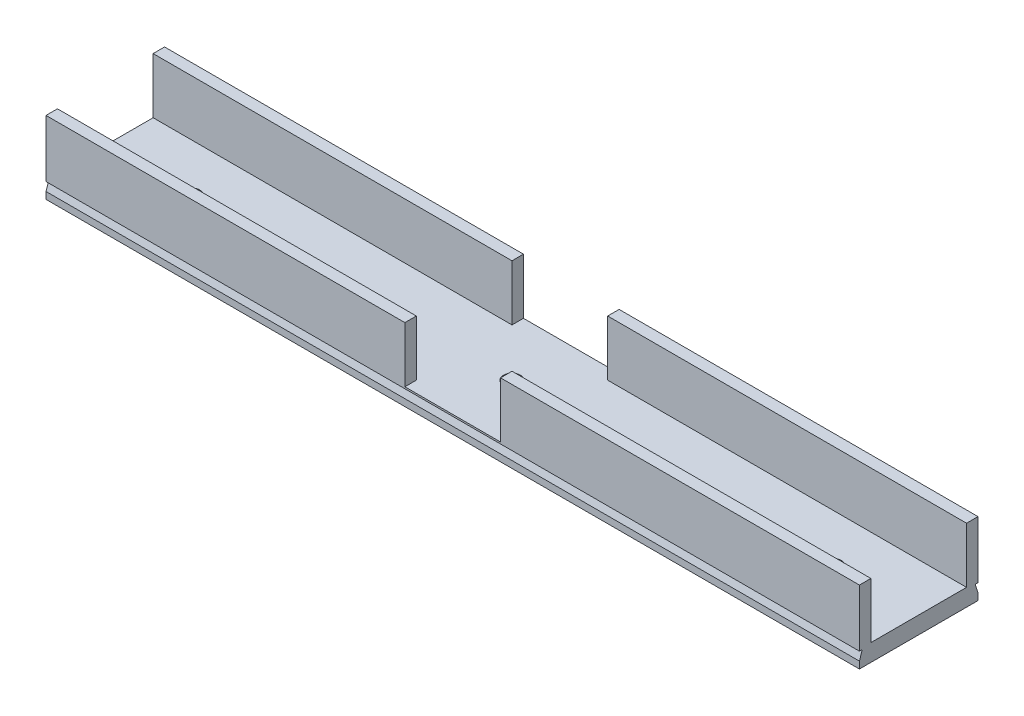
ISO-10303-21;
HEADER;
FILE_DESCRIPTION(('STEP AP214'),'2;1');
FILE_NAME('part.step','',(''),(''),'','','');
FILE_SCHEMA(('AUTOMOTIVE_DESIGN { 1 0 10303 214 1 1 1 1 }'));
ENDSEC;
DATA;
#1=APPLICATION_CONTEXT('core data for automotive mechanical design processes');
#2=APPLICATION_PROTOCOL_DEFINITION('international standard','automotive_design',2000,#1);
#3=PRODUCT_CONTEXT('',#1,'mechanical');
#4=PRODUCT('Part','Part','',(#3));
#5=PRODUCT_RELATED_PRODUCT_CATEGORY('part','',(#4));
#6=PRODUCT_DEFINITION_FORMATION('','',#4);
#7=PRODUCT_DEFINITION_CONTEXT('part definition',#1,'design');
#8=PRODUCT_DEFINITION('design','',#6,#7);
#9=PRODUCT_DEFINITION_SHAPE('','',#8);
#10=(LENGTH_UNIT() NAMED_UNIT(*) SI_UNIT(.MILLI.,.METRE.));
#11=(NAMED_UNIT(*) PLANE_ANGLE_UNIT() SI_UNIT($,.RADIAN.));
#12=(NAMED_UNIT(*) SI_UNIT($,.STERADIAN.) SOLID_ANGLE_UNIT());
#13=UNCERTAINTY_MEASURE_WITH_UNIT(LENGTH_MEASURE(1.E-05),#10,'distance_accuracy_value','');
#14=(GEOMETRIC_REPRESENTATION_CONTEXT(3) GLOBAL_UNCERTAINTY_ASSIGNED_CONTEXT((#13)) GLOBAL_UNIT_ASSIGNED_CONTEXT((#10,
#11,#12)) REPRESENTATION_CONTEXT('',''));
#15=CARTESIAN_POINT('',(0.,0.,0.));
#16=DIRECTION('',(0.,0.,1.));
#17=DIRECTION('',(1.,0.,0.));
#18=AXIS2_PLACEMENT_3D('',#15,#16,#17);
#19=CARTESIAN_POINT('',(71.,12.7,-8.35000000000002));
#20=DIRECTION('',(0.,0.,-1.));
#21=DIRECTION('',(-1.,0.,0.));
#22=AXIS2_PLACEMENT_3D('',#19,#20,#21);
#23=PLANE('',#22);
#24=DIRECTION('',(1.,0.,0.));
#25=VECTOR('',#24,1.);
#26=CARTESIAN_POINT('',(71.,3.,-8.35000000000002));
#27=LINE('',#26,#25);
#28=CARTESIAN_POINT('',(-71.,3.,-8.35000000000001));
#29=VERTEX_POINT('',#28);
#30=CARTESIAN_POINT('',(-8.35,2.99999999999999,-8.35000000000001));
#31=VERTEX_POINT('',#30);
#32=EDGE_CURVE('E302',#29,#31,#27,.T.);
#33=ORIENTED_EDGE('',*,*,#32,.T.);
#34=DIRECTION('',(0.,1.,0.));
#35=VECTOR('',#34,1.);
#36=CARTESIAN_POINT('',(-8.35,12.7,-8.35000000000001));
#37=LINE('',#36,#35);
#38=CARTESIAN_POINT('',(-8.35,12.7,-8.35));
#39=VERTEX_POINT('',#38);
#40=EDGE_CURVE('E226',#31,#39,#37,.T.);
#41=ORIENTED_EDGE('',*,*,#40,.T.);
#42=DIRECTION('',(1.,0.,0.));
#43=VECTOR('',#42,1.);
#44=CARTESIAN_POINT('',(71.,12.7,-8.35000000000002));
#45=LINE('',#44,#43);
#46=CARTESIAN_POINT('',(-71.,12.7,-8.35));
#47=VERTEX_POINT('',#46);
#48=EDGE_CURVE('E288',#47,#39,#45,.T.);
#49=ORIENTED_EDGE('',*,*,#48,.F.);
#50=DIRECTION('',(0.,-1.,0.));
#51=VECTOR('',#50,1.);
#52=CARTESIAN_POINT('',(-71.,12.7,-8.35));
#53=LINE('',#52,#51);
#54=EDGE_CURVE('E301',#47,#29,#53,.T.);
#55=ORIENTED_EDGE('',*,*,#54,.T.);
#56=EDGE_LOOP('',(#33,#41,#49,#55));
#57=FACE_BOUND('',#56,.T.);
#58=ADVANCED_FACE('F35',(#57),#23,.F.);
#59=CARTESIAN_POINT('',(0.,12.7,0.));
#60=DIRECTION('',(0.,-1.,0.));
#61=DIRECTION('',(0.,0.,-1.));
#62=AXIS2_PLACEMENT_3D('',#59,#60,#61);
#63=PLANE('',#62);
#64=ORIENTED_EDGE('',*,*,#48,.T.);
#65=DIRECTION('',(0.,0.,1.));
#66=VECTOR('',#65,1.);
#67=CARTESIAN_POINT('',(-8.35,12.7,-69.65));
#68=LINE('',#67,#66);
#69=CARTESIAN_POINT('',(-8.35,12.7,-10.35));
#70=VERTEX_POINT('',#69);
#71=EDGE_CURVE('E210',#70,#39,#68,.T.);
#72=ORIENTED_EDGE('',*,*,#71,.F.);
#73=DIRECTION('',(-1.,0.,0.));
#74=VECTOR('',#73,1.);
#75=CARTESIAN_POINT('',(-71.,12.7,-10.35));
#76=LINE('',#75,#74);
#77=CARTESIAN_POINT('',(-71.,12.7,-10.35));
#78=VERTEX_POINT('',#77);
#79=EDGE_CURVE('E295',#70,#78,#76,.T.);
#80=ORIENTED_EDGE('',*,*,#79,.T.);
#81=DIRECTION('',(0.,0.,1.));
#82=VECTOR('',#81,1.);
#83=CARTESIAN_POINT('',(-71.,12.7,-8.35));
#84=LINE('',#83,#82);
#85=EDGE_CURVE('E299',#78,#47,#84,.T.);
#86=ORIENTED_EDGE('',*,*,#85,.T.);
#87=EDGE_LOOP('',(#64,#72,#80,#86));
#88=FACE_BOUND('',#87,.T.);
#89=ADVANCED_FACE('F397',(#88),#63,.F.);
#90=CARTESIAN_POINT('',(71.,12.7,8.35));
#91=DIRECTION('',(0.,0.,1.));
#92=DIRECTION('',(1.,0.,0.));
#93=AXIS2_PLACEMENT_3D('',#90,#91,#92);
#94=PLANE('',#93);
#95=DIRECTION('',(-1.,0.,0.));
#96=VECTOR('',#95,1.);
#97=CARTESIAN_POINT('',(71.,12.7,8.35));
#98=LINE('',#97,#96);
#99=CARTESIAN_POINT('',(-8.35,12.7,8.35));
#100=VERTEX_POINT('',#99);
#101=CARTESIAN_POINT('',(-71.,12.7,8.35000000000002));
#102=VERTEX_POINT('',#101);
#103=EDGE_CURVE('E269',#100,#102,#98,.T.);
#104=ORIENTED_EDGE('',*,*,#103,.F.);
#105=DIRECTION('',(0.,-1.,0.));
#106=VECTOR('',#105,1.);
#107=CARTESIAN_POINT('',(-8.35,12.7,8.35000000000001));
#108=LINE('',#107,#106);
#109=CARTESIAN_POINT('',(-8.35,2.99999999999999,8.35000000000001));
#110=VERTEX_POINT('',#109);
#111=EDGE_CURVE('E224',#100,#110,#108,.T.);
#112=ORIENTED_EDGE('',*,*,#111,.T.);
#113=DIRECTION('',(-1.,0.,0.));
#114=VECTOR('',#113,1.);
#115=CARTESIAN_POINT('',(71.,3.,8.35));
#116=LINE('',#115,#114);
#117=CARTESIAN_POINT('',(-71.,3.,8.35000000000002));
#118=VERTEX_POINT('',#117);
#119=EDGE_CURVE('E192',#110,#118,#116,.T.);
#120=ORIENTED_EDGE('',*,*,#119,.T.);
#121=DIRECTION('',(0.,-1.,0.));
#122=VECTOR('',#121,1.);
#123=CARTESIAN_POINT('',(-71.,12.7,8.35000000000002));
#124=LINE('',#123,#122);
#125=EDGE_CURVE('E280',#102,#118,#124,.T.);
#126=ORIENTED_EDGE('',*,*,#125,.F.);
#127=EDGE_LOOP('',(#104,#112,#120,#126));
#128=FACE_BOUND('',#127,.T.);
#129=ADVANCED_FACE('F408',(#128),#94,.F.);
#130=CARTESIAN_POINT('',(0.,12.7,0.));
#131=DIRECTION('',(0.,1.,0.));
#132=DIRECTION('',(0.,0.,1.));
#133=AXIS2_PLACEMENT_3D('',#130,#131,#132);
#134=PLANE('',#133);
#135=DIRECTION('',(0.,0.,1.));
#136=VECTOR('',#135,1.);
#137=CARTESIAN_POINT('',(-8.35,12.7,0.));
#138=LINE('',#137,#136);
#139=CARTESIAN_POINT('',(-8.35,12.7,10.35));
#140=VERTEX_POINT('',#139);
#141=EDGE_CURVE('E11',#100,#140,#138,.T.);
#142=ORIENTED_EDGE('',*,*,#141,.F.);
#143=ORIENTED_EDGE('',*,*,#103,.T.);
#144=DIRECTION('',(0.,0.,1.));
#145=VECTOR('',#144,1.);
#146=CARTESIAN_POINT('',(-71.,12.7,8.35000000000002));
#147=LINE('',#146,#145);
#148=CARTESIAN_POINT('',(-71.,12.7,10.35));
#149=VERTEX_POINT('',#148);
#150=EDGE_CURVE('E274',#102,#149,#147,.T.);
#151=ORIENTED_EDGE('',*,*,#150,.T.);
#152=DIRECTION('',(1.,0.,0.));
#153=VECTOR('',#152,1.);
#154=CARTESIAN_POINT('',(-71.,12.7,10.35));
#155=LINE('',#154,#153);
#156=EDGE_CURVE('E278',#149,#140,#155,.T.);
#157=ORIENTED_EDGE('',*,*,#156,.T.);
#158=EDGE_LOOP('',(#142,#143,#151,#157));
#159=FACE_BOUND('',#158,.T.);
#160=ADVANCED_FACE('F410',(#159),#134,.T.);
#161=CARTESIAN_POINT('',(0.,3.,-10.35));
#162=DIRECTION('',(0.,0.,1.));
#163=DIRECTION('',(1.,0.,0.));
#164=AXIS2_PLACEMENT_3D('',#161,#162,#163);
#165=PLANE('',#164);
#166=ORIENTED_EDGE('',*,*,#79,.F.);
#167=DIRECTION('',(0.,-1.,0.));
#168=VECTOR('',#167,1.);
#169=CARTESIAN_POINT('',(-8.35,3.,-10.35));
#170=LINE('',#169,#168);
#171=CARTESIAN_POINT('',(-8.35,2.99999999999999,-10.35));
#172=VERTEX_POINT('',#171);
#173=EDGE_CURVE('E229',#70,#172,#170,.T.);
#174=ORIENTED_EDGE('',*,*,#173,.T.);
#175=DIRECTION('',(1.,0.,0.));
#176=VECTOR('',#175,1.);
#177=CARTESIAN_POINT('',(0.,3.,-10.35));
#178=LINE('',#177,#176);
#179=CARTESIAN_POINT('',(8.35,2.99999999999999,-10.35));
#180=VERTEX_POINT('',#179);
#181=EDGE_CURVE('E232',#172,#180,#178,.T.);
#182=ORIENTED_EDGE('',*,*,#181,.T.);
#183=DIRECTION('',(0.,1.,0.));
#184=VECTOR('',#183,1.);
#185=CARTESIAN_POINT('',(8.35,3.,-10.35));
#186=LINE('',#185,#184);
#187=CARTESIAN_POINT('',(8.35,12.7,-10.35));
#188=VERTEX_POINT('',#187);
#189=EDGE_CURVE('E221',#180,#188,#186,.T.);
#190=ORIENTED_EDGE('',*,*,#189,.T.);
#191=CARTESIAN_POINT('',(71.,12.7,-10.35));
#192=VERTEX_POINT('',#191);
#193=EDGE_CURVE('E296',#192,#188,#76,.T.);
#194=ORIENTED_EDGE('',*,*,#193,.F.);
#195=DIRECTION('',(0.,-1.,0.));
#196=VECTOR('',#195,1.);
#197=CARTESIAN_POINT('',(71.,3.,-10.35));
#198=LINE('',#197,#196);
#199=CARTESIAN_POINT('',(71.,2.7,-10.35));
#200=VERTEX_POINT('',#199);
#201=EDGE_CURVE('E358',#192,#200,#198,.T.);
#202=ORIENTED_EDGE('',*,*,#201,.T.);
#203=DIRECTION('',(-1.,0.,0.));
#204=VECTOR('',#203,1.);
#205=CARTESIAN_POINT('',(153.,2.7,-10.35));
#206=LINE('',#205,#204);
#207=CARTESIAN_POINT('',(-71.,2.7,-10.35));
#208=VERTEX_POINT('',#207);
#209=EDGE_CURVE('E243',#200,#208,#206,.T.);
#210=ORIENTED_EDGE('',*,*,#209,.T.);
#211=DIRECTION('',(0.,-1.,0.));
#212=VECTOR('',#211,1.);
#213=CARTESIAN_POINT('',(-71.,3.,-10.35));
#214=LINE('',#213,#212);
#215=EDGE_CURVE('E354',#78,#208,#214,.T.);
#216=ORIENTED_EDGE('',*,*,#215,.F.);
#217=EDGE_LOOP('',(#166,#174,#182,#190,#194,#202,#210,#216));
#218=FACE_BOUND('',#217,.T.);
#219=ADVANCED_FACE('F387',(#218),#165,.F.);
#220=CARTESIAN_POINT('',(0.,3.,10.35));
#221=DIRECTION('',(0.,0.,1.));
#222=DIRECTION('',(1.,0.,0.));
#223=AXIS2_PLACEMENT_3D('',#220,#221,#222);
#224=PLANE('',#223);
#225=DIRECTION('',(1.,0.,0.));
#226=VECTOR('',#225,1.);
#227=CARTESIAN_POINT('',(0.,1.20000000000002,10.35));
#228=LINE('',#227,#226);
#229=CARTESIAN_POINT('',(-71.,1.2,10.35));
#230=VERTEX_POINT('',#229);
#231=CARTESIAN_POINT('',(71.,1.2,10.35));
#232=VERTEX_POINT('',#231);
#233=EDGE_CURVE('E363',#230,#232,#228,.T.);
#234=ORIENTED_EDGE('',*,*,#233,.F.);
#235=DIRECTION('',(0.,-1.,0.));
#236=VECTOR('',#235,1.);
#237=CARTESIAN_POINT('',(-71.,3.,10.35));
#238=LINE('',#237,#236);
#239=CARTESIAN_POINT('',(-71.,0.,10.35));
#240=VERTEX_POINT('',#239);
#241=EDGE_CURVE('E349',#230,#240,#238,.T.);
#242=ORIENTED_EDGE('',*,*,#241,.T.);
#243=DIRECTION('',(-1.,0.,0.));
#244=VECTOR('',#243,1.);
#245=CARTESIAN_POINT('',(0.,0.,10.35));
#246=LINE('',#245,#244);
#247=CARTESIAN_POINT('',(71.,0.,10.35));
#248=VERTEX_POINT('',#247);
#249=EDGE_CURVE('E333',#248,#240,#246,.T.);
#250=ORIENTED_EDGE('',*,*,#249,.F.);
#251=DIRECTION('',(0.,-1.,0.));
#252=VECTOR('',#251,1.);
#253=CARTESIAN_POINT('',(71.,3.,10.35));
#254=LINE('',#253,#252);
#255=EDGE_CURVE('E335',#232,#248,#254,.T.);
#256=ORIENTED_EDGE('',*,*,#255,.F.);
#257=EDGE_LOOP('',(#234,#242,#250,#256));
#258=FACE_BOUND('',#257,.T.);
#259=ADVANCED_FACE('F424',(#258),#224,.T.);
#260=CARTESIAN_POINT('',(0.,3.,0.));
#261=DIRECTION('',(0.,1.,0.));
#262=DIRECTION('',(0.,0.,1.));
#263=AXIS2_PLACEMENT_3D('',#260,#261,#262);
#264=PLANE('',#263);
#265=CARTESIAN_POINT('',(8.35,2.99999999999999,-8.35000000000001));
#266=VERTEX_POINT('',#265);
#267=CARTESIAN_POINT('',(71.,3.,-8.35000000000002));
#268=VERTEX_POINT('',#267);
#269=EDGE_CURVE('E287',#266,#268,#27,.T.);
#270=ORIENTED_EDGE('',*,*,#269,.F.);
#271=DIRECTION('',(0.,0.,1.));
#272=VECTOR('',#271,1.);
#273=CARTESIAN_POINT('',(8.35,2.99999999999999,-69.65));
#274=LINE('',#273,#272);
#275=EDGE_CURVE('E215',#180,#266,#274,.T.);
#276=ORIENTED_EDGE('',*,*,#275,.F.);
#277=ORIENTED_EDGE('',*,*,#181,.F.);
#278=DIRECTION('',(0.,0.,1.));
#279=VECTOR('',#278,1.);
#280=CARTESIAN_POINT('',(-8.35,2.99999999999999,-69.65));
#281=LINE('',#280,#279);
#282=EDGE_CURVE('E195',#172,#31,#281,.T.);
#283=ORIENTED_EDGE('',*,*,#282,.T.);
#284=ORIENTED_EDGE('',*,*,#32,.F.);
#285=DIRECTION('',(0.,0.,-1.));
#286=VECTOR('',#285,1.);
#287=CARTESIAN_POINT('',(-71.,3.,0.));
#288=LINE('',#287,#286);
#289=EDGE_CURVE('E332',#118,#29,#288,.T.);
#290=ORIENTED_EDGE('',*,*,#289,.F.);
#291=ORIENTED_EDGE('',*,*,#119,.F.);
#292=CARTESIAN_POINT('',(-8.35,2.99999999999999,10.35));
#293=VERTEX_POINT('',#292);
#294=EDGE_CURVE('E183',#110,#293,#281,.T.);
#295=ORIENTED_EDGE('',*,*,#294,.T.);
#296=DIRECTION('',(1.,0.,0.));
#297=VECTOR('',#296,1.);
#298=CARTESIAN_POINT('',(-8.35,2.99999999999999,10.35));
#299=LINE('',#298,#297);
#300=CARTESIAN_POINT('',(8.35,2.99999999999999,10.35));
#301=VERTEX_POINT('',#300);
#302=EDGE_CURVE('E190',#293,#301,#299,.T.);
#303=ORIENTED_EDGE('',*,*,#302,.T.);
#304=CARTESIAN_POINT('',(8.35,2.99999999999999,8.35000000000001));
#305=VERTEX_POINT('',#304);
#306=EDGE_CURVE('E216',#305,#301,#274,.T.);
#307=ORIENTED_EDGE('',*,*,#306,.F.);
#308=CARTESIAN_POINT('',(71.,3.,8.35));
#309=VERTEX_POINT('',#308);
#310=EDGE_CURVE('E270',#309,#305,#116,.T.);
#311=ORIENTED_EDGE('',*,*,#310,.F.);
#312=DIRECTION('',(0.,0.,-1.));
#313=VECTOR('',#312,1.);
#314=CARTESIAN_POINT('',(71.,3.,0.));
#315=LINE('',#314,#313);
#316=EDGE_CURVE('E329',#309,#268,#315,.T.);
#317=ORIENTED_EDGE('',*,*,#316,.T.);
#318=EDGE_LOOP('',(#270,#276,#277,#283,#284,#290,#291,#295,#303,#307,#311,#317));
#319=FACE_BOUND('',#318,.T.);
#320=CARTESIAN_POINT('',(56.,3.,0.));
#321=DIRECTION('',(0.,1.,0.));
#322=DIRECTION('',(0.,0.,-1.));
#323=AXIS2_PLACEMENT_3D('',#320,#321,#322);
#324=CIRCLE('',#323,1.5);
#325=CARTESIAN_POINT('',(56.,3.,-1.5));
#326=VERTEX_POINT('',#325);
#327=EDGE_CURVE('E310',#326,#326,#324,.T.);
#328=ORIENTED_EDGE('',*,*,#327,.F.);
#329=EDGE_LOOP('',(#328));
#330=FACE_BOUND('',#329,.T.);
#331=CARTESIAN_POINT('',(0.,3.,0.));
#332=DIRECTION('',(0.,1.,0.));
#333=DIRECTION('',(0.,0.,1.));
#334=AXIS2_PLACEMENT_3D('',#331,#332,#333);
#335=CIRCLE('',#334,1.5);
#336=CARTESIAN_POINT('',(0.,3.,1.5));
#337=VERTEX_POINT('',#336);
#338=EDGE_CURVE('E321',#337,#337,#335,.T.);
#339=ORIENTED_EDGE('',*,*,#338,.F.);
#340=EDGE_LOOP('',(#339));
#341=FACE_BOUND('',#340,.T.);
#342=CARTESIAN_POINT('',(-56.,3.,0.));
#343=DIRECTION('',(0.,1.,0.));
#344=DIRECTION('',(0.,0.,1.));
#345=AXIS2_PLACEMENT_3D('',#342,#343,#344);
#346=CIRCLE('',#345,1.5);
#347=CARTESIAN_POINT('',(-56.,3.,1.5));
#348=VERTEX_POINT('',#347);
#349=EDGE_CURVE('E315',#348,#348,#346,.T.);
#350=ORIENTED_EDGE('',*,*,#349,.F.);
#351=EDGE_LOOP('',(#350));
#352=FACE_BOUND('',#351,.T.);
#353=ADVANCED_FACE('F186',(#319,#330,#341,#352),#264,.T.);
#354=CARTESIAN_POINT('',(71.,3.,0.));
#355=DIRECTION('',(-1.,0.,0.));
#356=DIRECTION('',(0.,0.,1.));
#357=AXIS2_PLACEMENT_3D('',#354,#355,#356);
#358=PLANE('',#357);
#359=DIRECTION('',(0.,0.948683298050513,0.316227766016839));
#360=VECTOR('',#359,1.);
#361=CARTESIAN_POINT('',(71.,5.92500000000001,-8.77499999999999));
#362=LINE('',#361,#360);
#363=CARTESIAN_POINT('',(71.,1.2,-10.35));
#364=VERTEX_POINT('',#363);
#365=CARTESIAN_POINT('',(71.,2.7,-9.85));
#366=VERTEX_POINT('',#365);
#367=EDGE_CURVE('E260',#364,#366,#362,.T.);
#368=ORIENTED_EDGE('',*,*,#367,.T.);
#369=DIRECTION('',(0.,0.,-1.));
#370=VECTOR('',#369,1.);
#371=CARTESIAN_POINT('',(71.,2.7,0.));
#372=LINE('',#371,#370);
#373=EDGE_CURVE('E263',#366,#200,#372,.T.);
#374=ORIENTED_EDGE('',*,*,#373,.T.);
#375=ORIENTED_EDGE('',*,*,#201,.F.);
#376=DIRECTION('',(0.,0.,-1.));
#377=VECTOR('',#376,1.);
#378=CARTESIAN_POINT('',(71.,12.7,-10.35));
#379=LINE('',#378,#377);
#380=CARTESIAN_POINT('',(71.,12.7,-8.35000000000002));
#381=VERTEX_POINT('',#380);
#382=EDGE_CURVE('E291',#381,#192,#379,.T.);
#383=ORIENTED_EDGE('',*,*,#382,.F.);
#384=DIRECTION('',(0.,-1.,0.));
#385=VECTOR('',#384,1.);
#386=CARTESIAN_POINT('',(71.,12.7,-8.35000000000002));
#387=LINE('',#386,#385);
#388=EDGE_CURVE('E307',#381,#268,#387,.T.);
#389=ORIENTED_EDGE('',*,*,#388,.T.);
#390=ORIENTED_EDGE('',*,*,#316,.F.);
#391=DIRECTION('',(0.,-1.,0.));
#392=VECTOR('',#391,1.);
#393=CARTESIAN_POINT('',(71.,12.7,8.35));
#394=LINE('',#393,#392);
#395=CARTESIAN_POINT('',(71.,12.7,8.35));
#396=VERTEX_POINT('',#395);
#397=EDGE_CURVE('E285',#396,#309,#394,.T.);
#398=ORIENTED_EDGE('',*,*,#397,.F.);
#399=DIRECTION('',(0.,0.,-1.));
#400=VECTOR('',#399,1.);
#401=CARTESIAN_POINT('',(71.,12.7,10.35));
#402=LINE('',#401,#400);
#403=CARTESIAN_POINT('',(71.,12.7,10.35));
#404=VERTEX_POINT('',#403);
#405=EDGE_CURVE('E266',#404,#396,#402,.T.);
#406=ORIENTED_EDGE('',*,*,#405,.F.);
#407=CARTESIAN_POINT('',(71.,2.7,10.35));
#408=VERTEX_POINT('',#407);
#409=EDGE_CURVE('E346',#404,#408,#254,.T.);
#410=ORIENTED_EDGE('',*,*,#409,.T.);
#411=DIRECTION('',(0.,0.,-1.));
#412=VECTOR('',#411,1.);
#413=CARTESIAN_POINT('',(71.,2.7,0.));
#414=LINE('',#413,#412);
#415=CARTESIAN_POINT('',(71.,2.7,9.85));
#416=VERTEX_POINT('',#415);
#417=EDGE_CURVE('E246',#408,#416,#414,.T.);
#418=ORIENTED_EDGE('',*,*,#417,.T.);
#419=DIRECTION('',(0.,-0.948683298050513,0.316227766016839));
#420=VECTOR('',#419,1.);
#421=CARTESIAN_POINT('',(71.,5.92500000000001,8.77499999999999));
#422=LINE('',#421,#420);
#423=EDGE_CURVE('E257',#416,#232,#422,.T.);
#424=ORIENTED_EDGE('',*,*,#423,.T.);
#425=ORIENTED_EDGE('',*,*,#255,.T.);
#426=DIRECTION('',(0.,0.,-1.));
#427=VECTOR('',#426,1.);
#428=CARTESIAN_POINT('',(71.,0.,0.));
#429=LINE('',#428,#427);
#430=CARTESIAN_POINT('',(71.,0.,-10.35));
#431=VERTEX_POINT('',#430);
#432=EDGE_CURVE('E314',#248,#431,#429,.T.);
#433=ORIENTED_EDGE('',*,*,#432,.T.);
#434=EDGE_CURVE('E357',#364,#431,#198,.T.);
#435=ORIENTED_EDGE('',*,*,#434,.F.);
#436=EDGE_LOOP('',(#368,#374,#375,#383,#389,#390,#398,#406,#410,#418,#424,#425,#433,#435));
#437=FACE_BOUND('',#436,.T.);
#438=ADVANCED_FACE('F37',(#437),#358,.F.);
#439=CARTESIAN_POINT('',(-71.,1.2,-10.35));
#440=VERTEX_POINT('',#439);
#441=CARTESIAN_POINT('',(-71.,0.,-10.35));
#442=VERTEX_POINT('',#441);
#443=EDGE_CURVE('E353',#440,#442,#214,.T.);
#444=ORIENTED_EDGE('',*,*,#443,.F.);
#445=DIRECTION('',(-1.,0.,0.));
#446=VECTOR('',#445,1.);
#447=CARTESIAN_POINT('',(153.,1.2,-10.35));
#448=LINE('',#447,#446);
#449=EDGE_CURVE('E242',#364,#440,#448,.T.);
#450=ORIENTED_EDGE('',*,*,#449,.F.);
#451=ORIENTED_EDGE('',*,*,#434,.T.);
#452=DIRECTION('',(-1.,0.,0.));
#453=VECTOR('',#452,1.);
#454=CARTESIAN_POINT('',(0.,0.,-10.35));
#455=LINE('',#454,#453);
#456=EDGE_CURVE('E338',#431,#442,#455,.T.);
#457=ORIENTED_EDGE('',*,*,#456,.T.);
#458=EDGE_LOOP('',(#444,#450,#451,#457));
#459=FACE_BOUND('',#458,.T.);
#460=ADVANCED_FACE('F433',(#459),#165,.F.);
#461=CARTESIAN_POINT('',(-71.,3.,0.));
#462=DIRECTION('',(-1.,0.,0.));
#463=DIRECTION('',(0.,0.,1.));
#464=AXIS2_PLACEMENT_3D('',#461,#462,#463);
#465=PLANE('',#464);
#466=DIRECTION('',(0.,0.,-1.));
#467=VECTOR('',#466,1.);
#468=CARTESIAN_POINT('',(-71.,2.7,-10.35));
#469=LINE('',#468,#467);
#470=CARTESIAN_POINT('',(-71.,2.7,-9.85));
#471=VERTEX_POINT('',#470);
#472=EDGE_CURVE('E239',#471,#208,#469,.T.);
#473=ORIENTED_EDGE('',*,*,#472,.F.);
#474=DIRECTION('',(0.,0.948683298050513,0.316227766016839));
#475=VECTOR('',#474,1.);
#476=CARTESIAN_POINT('',(-71.,2.7,-9.85));
#477=LINE('',#476,#475);
#478=EDGE_CURVE('E236',#440,#471,#477,.T.);
#479=ORIENTED_EDGE('',*,*,#478,.F.);
#480=ORIENTED_EDGE('',*,*,#443,.T.);
#481=DIRECTION('',(0.,0.,-1.));
#482=VECTOR('',#481,1.);
#483=CARTESIAN_POINT('',(-71.,0.,0.));
#484=LINE('',#483,#482);
#485=EDGE_CURVE('E341',#240,#442,#484,.T.);
#486=ORIENTED_EDGE('',*,*,#485,.F.);
#487=ORIENTED_EDGE('',*,*,#241,.F.);
#488=DIRECTION('',(0.,-0.948683298050513,0.316227766016839));
#489=VECTOR('',#488,1.);
#490=CARTESIAN_POINT('',(-71.,2.7,9.85));
#491=LINE('',#490,#489);
#492=CARTESIAN_POINT('',(-71.,2.7,9.85));
#493=VERTEX_POINT('',#492);
#494=EDGE_CURVE('E252',#493,#230,#491,.T.);
#495=ORIENTED_EDGE('',*,*,#494,.F.);
#496=DIRECTION('',(0.,0.,-1.));
#497=VECTOR('',#496,1.);
#498=CARTESIAN_POINT('',(-71.,2.7,10.35));
#499=LINE('',#498,#497);
#500=CARTESIAN_POINT('',(-71.,2.7,10.35));
#501=VERTEX_POINT('',#500);
#502=EDGE_CURVE('E235',#501,#493,#499,.T.);
#503=ORIENTED_EDGE('',*,*,#502,.F.);
#504=EDGE_CURVE('E350',#149,#501,#238,.T.);
#505=ORIENTED_EDGE('',*,*,#504,.F.);
#506=ORIENTED_EDGE('',*,*,#150,.F.);
#507=ORIENTED_EDGE('',*,*,#125,.T.);
#508=ORIENTED_EDGE('',*,*,#289,.T.);
#509=ORIENTED_EDGE('',*,*,#54,.F.);
#510=ORIENTED_EDGE('',*,*,#85,.F.);
#511=ORIENTED_EDGE('',*,*,#215,.T.);
#512=EDGE_LOOP('',(#473,#479,#480,#486,#487,#495,#503,#505,#506,#507,#508,#509,#510,#511));
#513=FACE_BOUND('',#512,.T.);
#514=ADVANCED_FACE('F403',(#513),#465,.T.);
#515=DIRECTION('',(0.,-1.,0.));
#516=VECTOR('',#515,1.);
#517=CARTESIAN_POINT('',(-8.35,2.99999999999999,10.35));
#518=LINE('',#517,#516);
#519=EDGE_CURVE('E198',#140,#293,#518,.T.);
#520=ORIENTED_EDGE('',*,*,#519,.F.);
#521=ORIENTED_EDGE('',*,*,#156,.F.);
#522=ORIENTED_EDGE('',*,*,#504,.T.);
#523=DIRECTION('',(-1.,0.,0.));
#524=VECTOR('',#523,1.);
#525=CARTESIAN_POINT('',(0.,2.7,10.35));
#526=LINE('',#525,#524);
#527=EDGE_CURVE('E361',#408,#501,#526,.T.);
#528=ORIENTED_EDGE('',*,*,#527,.F.);
#529=ORIENTED_EDGE('',*,*,#409,.F.);
#530=CARTESIAN_POINT('',(8.35,12.7,10.35));
#531=VERTEX_POINT('',#530);
#532=EDGE_CURVE('E277',#531,#404,#155,.T.);
#533=ORIENTED_EDGE('',*,*,#532,.F.);
#534=DIRECTION('',(0.,1.,0.));
#535=VECTOR('',#534,1.);
#536=CARTESIAN_POINT('',(8.35,2.99999999999999,10.35));
#537=LINE('',#536,#535);
#538=EDGE_CURVE('E58',#301,#531,#537,.T.);
#539=ORIENTED_EDGE('',*,*,#538,.F.);
#540=ORIENTED_EDGE('',*,*,#302,.F.);
#541=EDGE_LOOP('',(#520,#521,#522,#528,#529,#533,#539,#540));
#542=FACE_BOUND('',#541,.T.);
#543=ADVANCED_FACE('F205',(#542),#224,.T.);
#544=CARTESIAN_POINT('',(0.,0.,0.));
#545=DIRECTION('',(0.,1.,0.));
#546=DIRECTION('',(0.,0.,1.));
#547=AXIS2_PLACEMENT_3D('',#544,#545,#546);
#548=PLANE('',#547);
#549=CARTESIAN_POINT('',(-56.,0.,0.));
#550=DIRECTION('',(0.,1.,0.));
#551=DIRECTION('',(0.,0.,1.));
#552=AXIS2_PLACEMENT_3D('',#549,#550,#551);
#553=CIRCLE('',#552,1.5);
#554=CARTESIAN_POINT('',(-56.,0.,1.5));
#555=VERTEX_POINT('',#554);
#556=EDGE_CURVE('E311',#555,#555,#553,.T.);
#557=ORIENTED_EDGE('',*,*,#556,.T.);
#558=EDGE_LOOP('',(#557));
#559=FACE_BOUND('',#558,.T.);
#560=CARTESIAN_POINT('',(0.,0.,0.));
#561=DIRECTION('',(0.,1.,0.));
#562=DIRECTION('',(0.,0.,1.));
#563=AXIS2_PLACEMENT_3D('',#560,#561,#562);
#564=CIRCLE('',#563,1.5);
#565=CARTESIAN_POINT('',(0.,0.,1.5));
#566=VERTEX_POINT('',#565);
#567=EDGE_CURVE('E318',#566,#566,#564,.T.);
#568=ORIENTED_EDGE('',*,*,#567,.T.);
#569=EDGE_LOOP('',(#568));
#570=FACE_BOUND('',#569,.T.);
#571=CARTESIAN_POINT('',(56.,0.,0.));
#572=DIRECTION('',(0.,1.,0.));
#573=DIRECTION('',(0.,0.,-1.));
#574=AXIS2_PLACEMENT_3D('',#571,#572,#573);
#575=CIRCLE('',#574,1.5);
#576=CARTESIAN_POINT('',(56.,0.,-1.5));
#577=VERTEX_POINT('',#576);
#578=EDGE_CURVE('E324',#577,#577,#575,.T.);
#579=ORIENTED_EDGE('',*,*,#578,.T.);
#580=EDGE_LOOP('',(#579));
#581=FACE_BOUND('',#580,.T.);
#582=ORIENTED_EDGE('',*,*,#432,.F.);
#583=ORIENTED_EDGE('',*,*,#249,.T.);
#584=ORIENTED_EDGE('',*,*,#485,.T.);
#585=ORIENTED_EDGE('',*,*,#456,.F.);
#586=EDGE_LOOP('',(#582,#583,#584,#585));
#587=FACE_BOUND('',#586,.T.);
#588=ADVANCED_FACE('F427',(#559,#570,#581,#587),#548,.F.);
#589=CARTESIAN_POINT('',(56.,0.,0.));
#590=DIRECTION('',(0.,1.,0.));
#591=DIRECTION('',(0.,0.,1.));
#592=AXIS2_PLACEMENT_3D('',#589,#590,#591);
#593=CYLINDRICAL_SURFACE('',#592,1.5);
#594=ORIENTED_EDGE('',*,*,#578,.F.);
#595=EDGE_LOOP('',(#594));
#596=FACE_BOUND('',#595,.T.);
#597=ORIENTED_EDGE('',*,*,#327,.T.);
#598=EDGE_LOOP('',(#597));
#599=FACE_BOUND('',#598,.T.);
#600=ADVANCED_FACE('F470',(#596,#599),#593,.F.);
#601=CARTESIAN_POINT('',(0.,0.,0.));
#602=DIRECTION('',(0.,1.,0.));
#603=DIRECTION('',(0.,0.,1.));
#604=AXIS2_PLACEMENT_3D('',#601,#602,#603);
#605=CYLINDRICAL_SURFACE('',#604,1.5);
#606=ORIENTED_EDGE('',*,*,#567,.F.);
#607=EDGE_LOOP('',(#606));
#608=FACE_BOUND('',#607,.T.);
#609=ORIENTED_EDGE('',*,*,#338,.T.);
#610=EDGE_LOOP('',(#609));
#611=FACE_BOUND('',#610,.T.);
#612=ADVANCED_FACE('F465',(#608,#611),#605,.F.);
#613=CARTESIAN_POINT('',(-56.,0.,0.));
#614=DIRECTION('',(0.,1.,0.));
#615=DIRECTION('',(0.,0.,1.));
#616=AXIS2_PLACEMENT_3D('',#613,#614,#615);
#617=CYLINDRICAL_SURFACE('',#616,1.5);
#618=ORIENTED_EDGE('',*,*,#556,.F.);
#619=EDGE_LOOP('',(#618));
#620=FACE_BOUND('',#619,.T.);
#621=ORIENTED_EDGE('',*,*,#349,.T.);
#622=EDGE_LOOP('',(#621));
#623=FACE_BOUND('',#622,.T.);
#624=ADVANCED_FACE('F459',(#620,#623),#617,.F.);
#625=CARTESIAN_POINT('',(8.35,12.7,-8.35000000000001));
#626=VERTEX_POINT('',#625);
#627=EDGE_CURVE('E292',#626,#381,#45,.T.);
#628=ORIENTED_EDGE('',*,*,#627,.F.);
#629=DIRECTION('',(0.,-1.,0.));
#630=VECTOR('',#629,1.);
#631=CARTESIAN_POINT('',(8.35,12.7,-8.35000000000001));
#632=LINE('',#631,#630);
#633=EDGE_CURVE('E50',#626,#266,#632,.T.);
#634=ORIENTED_EDGE('',*,*,#633,.T.);
#635=ORIENTED_EDGE('',*,*,#269,.T.);
#636=ORIENTED_EDGE('',*,*,#388,.F.);
#637=EDGE_LOOP('',(#628,#634,#635,#636));
#638=FACE_BOUND('',#637,.T.);
#639=ADVANCED_FACE('F380',(#638),#23,.F.);
#640=ORIENTED_EDGE('',*,*,#193,.T.);
#641=DIRECTION('',(0.,0.,1.));
#642=VECTOR('',#641,1.);
#643=CARTESIAN_POINT('',(8.35,12.7,-69.65));
#644=LINE('',#643,#642);
#645=EDGE_CURVE('E213',#188,#626,#644,.T.);
#646=ORIENTED_EDGE('',*,*,#645,.T.);
#647=ORIENTED_EDGE('',*,*,#627,.T.);
#648=ORIENTED_EDGE('',*,*,#382,.T.);
#649=EDGE_LOOP('',(#640,#646,#647,#648));
#650=FACE_BOUND('',#649,.T.);
#651=ADVANCED_FACE('F382',(#650),#63,.F.);
#652=ORIENTED_EDGE('',*,*,#310,.T.);
#653=DIRECTION('',(0.,1.,0.));
#654=VECTOR('',#653,1.);
#655=CARTESIAN_POINT('',(8.35,12.7,8.35000000000001));
#656=LINE('',#655,#654);
#657=CARTESIAN_POINT('',(8.35,12.7,8.35));
#658=VERTEX_POINT('',#657);
#659=EDGE_CURVE('E212',#305,#658,#656,.T.);
#660=ORIENTED_EDGE('',*,*,#659,.T.);
#661=EDGE_CURVE('E271',#396,#658,#98,.T.);
#662=ORIENTED_EDGE('',*,*,#661,.F.);
#663=ORIENTED_EDGE('',*,*,#397,.T.);
#664=EDGE_LOOP('',(#652,#660,#662,#663));
#665=FACE_BOUND('',#664,.T.);
#666=ADVANCED_FACE('F367',(#665),#94,.F.);
#667=DIRECTION('',(0.,0.,-1.));
#668=VECTOR('',#667,1.);
#669=CARTESIAN_POINT('',(8.35,12.7,0.));
#670=LINE('',#669,#668);
#671=EDGE_CURVE('E43',#531,#658,#670,.T.);
#672=ORIENTED_EDGE('',*,*,#671,.F.);
#673=ORIENTED_EDGE('',*,*,#532,.T.);
#674=ORIENTED_EDGE('',*,*,#405,.T.);
#675=ORIENTED_EDGE('',*,*,#661,.T.);
#676=EDGE_LOOP('',(#672,#673,#674,#675));
#677=FACE_BOUND('',#676,.T.);
#678=ADVANCED_FACE('F369',(#677),#134,.T.);
#679=CARTESIAN_POINT('',(153.,2.7,9.85));
#680=DIRECTION('',(0.,-0.316227766016839,-0.948683298050513));
#681=DIRECTION('',(0.,0.948683298050513,-0.316227766016839));
#682=AXIS2_PLACEMENT_3D('',#679,#680,#681);
#683=PLANE('',#682);
#684=DIRECTION('',(-1.,0.,0.));
#685=VECTOR('',#684,1.);
#686=CARTESIAN_POINT('',(153.,2.7,9.85));
#687=LINE('',#686,#685);
#688=EDGE_CURVE('E240',#416,#493,#687,.T.);
#689=ORIENTED_EDGE('',*,*,#688,.T.);
#690=ORIENTED_EDGE('',*,*,#494,.T.);
#691=ORIENTED_EDGE('',*,*,#233,.T.);
#692=ORIENTED_EDGE('',*,*,#423,.F.);
#693=EDGE_LOOP('',(#689,#690,#691,#692));
#694=FACE_BOUND('',#693,.T.);
#695=ADVANCED_FACE('F447',(#694),#683,.F.);
#696=CARTESIAN_POINT('',(153.,2.7,10.35));
#697=DIRECTION('',(0.,1.,0.));
#698=DIRECTION('',(0.,0.,1.));
#699=AXIS2_PLACEMENT_3D('',#696,#697,#698);
#700=PLANE('',#699);
#701=ORIENTED_EDGE('',*,*,#527,.T.);
#702=ORIENTED_EDGE('',*,*,#502,.T.);
#703=ORIENTED_EDGE('',*,*,#688,.F.);
#704=ORIENTED_EDGE('',*,*,#417,.F.);
#705=EDGE_LOOP('',(#701,#702,#703,#704));
#706=FACE_BOUND('',#705,.T.);
#707=ADVANCED_FACE('F417',(#706),#700,.F.);
#708=CARTESIAN_POINT('',(153.,2.7,-10.35));
#709=DIRECTION('',(0.,1.,0.));
#710=DIRECTION('',(0.,0.,1.));
#711=AXIS2_PLACEMENT_3D('',#708,#709,#710);
#712=PLANE('',#711);
#713=DIRECTION('',(-1.,0.,0.));
#714=VECTOR('',#713,1.);
#715=CARTESIAN_POINT('',(153.,2.7,-9.85));
#716=LINE('',#715,#714);
#717=EDGE_CURVE('E247',#366,#471,#716,.T.);
#718=ORIENTED_EDGE('',*,*,#717,.T.);
#719=ORIENTED_EDGE('',*,*,#472,.T.);
#720=ORIENTED_EDGE('',*,*,#209,.F.);
#721=ORIENTED_EDGE('',*,*,#373,.F.);
#722=EDGE_LOOP('',(#718,#719,#720,#721));
#723=FACE_BOUND('',#722,.T.);
#724=ADVANCED_FACE('F439',(#723),#712,.F.);
#725=CARTESIAN_POINT('',(153.,2.7,-9.85));
#726=DIRECTION('',(0.,-0.316227766016839,0.948683298050513));
#727=DIRECTION('',(0.,-0.948683298050513,-0.316227766016839));
#728=AXIS2_PLACEMENT_3D('',#725,#726,#727);
#729=PLANE('',#728);
#730=ORIENTED_EDGE('',*,*,#449,.T.);
#731=ORIENTED_EDGE('',*,*,#478,.T.);
#732=ORIENTED_EDGE('',*,*,#717,.F.);
#733=ORIENTED_EDGE('',*,*,#367,.F.);
#734=EDGE_LOOP('',(#730,#731,#732,#733));
#735=FACE_BOUND('',#734,.T.);
#736=ADVANCED_FACE('F436',(#735),#729,.F.);
#737=CARTESIAN_POINT('',(8.35,2.99999999999999,-69.65));
#738=DIRECTION('',(1.,0.,0.));
#739=DIRECTION('',(0.,1.,0.));
#740=AXIS2_PLACEMENT_3D('',#737,#738,#739);
#741=PLANE('',#740);
#742=ORIENTED_EDGE('',*,*,#306,.T.);
#743=ORIENTED_EDGE('',*,*,#538,.T.);
#744=ORIENTED_EDGE('',*,*,#671,.T.);
#745=ORIENTED_EDGE('',*,*,#659,.F.);
#746=EDGE_LOOP('',(#742,#743,#744,#745));
#747=FACE_BOUND('',#746,.T.);
#748=ADVANCED_FACE('F364',(#747),#741,.F.);
#749=CARTESIAN_POINT('',(-8.35,2.99999999999999,-69.65));
#750=DIRECTION('',(-1.,0.,0.));
#751=DIRECTION('',(0.,0.,1.));
#752=AXIS2_PLACEMENT_3D('',#749,#750,#751);
#753=PLANE('',#752);
#754=ORIENTED_EDGE('',*,*,#141,.T.);
#755=ORIENTED_EDGE('',*,*,#519,.T.);
#756=ORIENTED_EDGE('',*,*,#294,.F.);
#757=ORIENTED_EDGE('',*,*,#111,.F.);
#758=EDGE_LOOP('',(#754,#755,#756,#757));
#759=FACE_BOUND('',#758,.T.);
#760=ADVANCED_FACE('F199',(#759),#753,.F.);
#761=ORIENTED_EDGE('',*,*,#71,.T.);
#762=ORIENTED_EDGE('',*,*,#40,.F.);
#763=ORIENTED_EDGE('',*,*,#282,.F.);
#764=ORIENTED_EDGE('',*,*,#173,.F.);
#765=EDGE_LOOP('',(#761,#762,#763,#764));
#766=FACE_BOUND('',#765,.T.);
#767=ADVANCED_FACE('F392',(#766),#753,.F.);
#768=ORIENTED_EDGE('',*,*,#275,.T.);
#769=ORIENTED_EDGE('',*,*,#633,.F.);
#770=ORIENTED_EDGE('',*,*,#645,.F.);
#771=ORIENTED_EDGE('',*,*,#189,.F.);
#772=EDGE_LOOP('',(#768,#769,#770,#771));
#773=FACE_BOUND('',#772,.T.);
#774=ADVANCED_FACE('F384',(#773),#741,.F.);
#775=CLOSED_SHELL('',(#58,#89,#129,#160,#219,#259,#353,#438,#460,#514,#543,#588,#600,#612,#624,
#639,#651,#666,#678,#695,#707,#724,#736,#748,#760,#767,#774));
#776=MANIFOLD_SOLID_BREP('B2',#775);
#777=ADVANCED_BREP_SHAPE_REPRESENTATION('',(#18,#776),#14);
#778=SHAPE_DEFINITION_REPRESENTATION(#9,#777);
ENDSEC;
END-ISO-10303-21;
